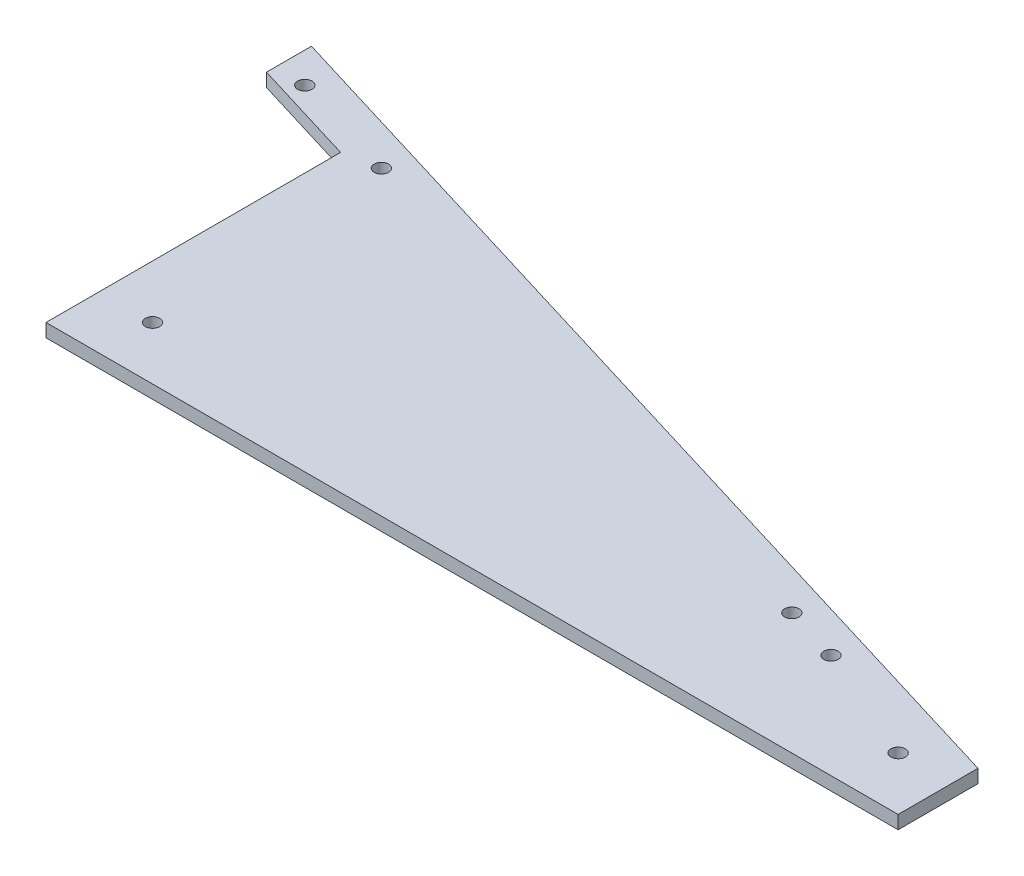
ISO-10303-21;
HEADER;
FILE_DESCRIPTION(('STEP AP214'),'2;1');
FILE_NAME('part.step','',(''),(''),'','','');
FILE_SCHEMA(('AUTOMOTIVE_DESIGN { 1 0 10303 214 1 1 1 1 }'));
ENDSEC;
DATA;
#1=APPLICATION_CONTEXT('core data for automotive mechanical design processes');
#2=APPLICATION_PROTOCOL_DEFINITION('international standard','automotive_design',2000,#1);
#3=PRODUCT_CONTEXT('',#1,'mechanical');
#4=PRODUCT('Part','Part','',(#3));
#5=PRODUCT_RELATED_PRODUCT_CATEGORY('part','',(#4));
#6=PRODUCT_DEFINITION_FORMATION('','',#4);
#7=PRODUCT_DEFINITION_CONTEXT('part definition',#1,'design');
#8=PRODUCT_DEFINITION('design','',#6,#7);
#9=PRODUCT_DEFINITION_SHAPE('','',#8);
#10=(LENGTH_UNIT() NAMED_UNIT(*) SI_UNIT(.MILLI.,.METRE.));
#11=(NAMED_UNIT(*) PLANE_ANGLE_UNIT() SI_UNIT($,.RADIAN.));
#12=(NAMED_UNIT(*) SI_UNIT($,.STERADIAN.) SOLID_ANGLE_UNIT());
#13=UNCERTAINTY_MEASURE_WITH_UNIT(LENGTH_MEASURE(1.E-05),#10,'distance_accuracy_value','');
#14=(GEOMETRIC_REPRESENTATION_CONTEXT(3) GLOBAL_UNCERTAINTY_ASSIGNED_CONTEXT((#13)) GLOBAL_UNIT_ASSIGNED_CONTEXT((#10,
#11,#12)) REPRESENTATION_CONTEXT('',''));
#15=CARTESIAN_POINT('',(0.,0.,0.));
#16=DIRECTION('',(0.,0.,1.));
#17=DIRECTION('',(1.,0.,0.));
#18=AXIS2_PLACEMENT_3D('',#15,#16,#17);
#19=CARTESIAN_POINT('',(0.,6.35,-161.925));
#20=DIRECTION('',(1.,0.,0.));
#21=DIRECTION('',(0.,0.,-1.));
#22=AXIS2_PLACEMENT_3D('',#19,#20,#21);
#23=PLANE('',#22);
#24=DIRECTION('',(0.,1.,0.));
#25=VECTOR('',#24,1.);
#26=CARTESIAN_POINT('',(0.,0.,-140.483107961387));
#27=LINE('',#26,#25);
#28=CARTESIAN_POINT('',(0.,0.,-140.483107961387));
#29=VERTEX_POINT('',#28);
#30=CARTESIAN_POINT('',(0.,6.35,-140.483107961387));
#31=VERTEX_POINT('',#30);
#32=EDGE_CURVE('E56',#29,#31,#27,.T.);
#33=ORIENTED_EDGE('',*,*,#32,.F.);
#34=DIRECTION('',(0.,0.,1.));
#35=VECTOR('',#34,1.);
#36=CARTESIAN_POINT('',(0.,0.,-161.925));
#37=LINE('',#36,#35);
#38=CARTESIAN_POINT('',(0.,0.,0.));
#39=VERTEX_POINT('',#38);
#40=EDGE_CURVE('E158',#29,#39,#37,.T.);
#41=ORIENTED_EDGE('',*,*,#40,.T.);
#42=DIRECTION('',(0.,-1.,0.));
#43=VECTOR('',#42,1.);
#44=CARTESIAN_POINT('',(0.,6.35,0.));
#45=LINE('',#44,#43);
#46=CARTESIAN_POINT('',(0.,6.35,0.));
#47=VERTEX_POINT('',#46);
#48=EDGE_CURVE('E11',#47,#39,#45,.T.);
#49=ORIENTED_EDGE('',*,*,#48,.F.);
#50=DIRECTION('',(0.,0.,1.));
#51=VECTOR('',#50,1.);
#52=CARTESIAN_POINT('',(0.,6.35,-161.925));
#53=LINE('',#52,#51);
#54=EDGE_CURVE('E85',#31,#47,#53,.T.);
#55=ORIENTED_EDGE('',*,*,#54,.F.);
#56=EDGE_LOOP('',(#33,#41,#49,#55));
#57=FACE_BOUND('',#56,.T.);
#58=ADVANCED_FACE('F41',(#57),#23,.F.);
#59=CARTESIAN_POINT('',(0.,6.35,0.));
#60=DIRECTION('',(0.,1.,0.));
#61=DIRECTION('',(0.,0.,1.));
#62=AXIS2_PLACEMENT_3D('',#59,#60,#61);
#63=PLANE('',#62);
#64=CARTESIAN_POINT('',(324.672621662797,6.35,-49.7248926931691));
#65=DIRECTION('',(0.,1.,0.));
#66=DIRECTION('',(0.,0.,1.));
#67=AXIS2_PLACEMENT_3D('',#64,#65,#66);
#68=CIRCLE('',#67,3.429);
#69=CARTESIAN_POINT('',(324.672621662797,6.35,-46.2958926931691));
#70=VERTEX_POINT('',#69);
#71=EDGE_CURVE('E338',#70,#70,#68,.T.);
#72=ORIENTED_EDGE('',*,*,#71,.F.);
#73=EDGE_LOOP('',(#72));
#74=FACE_BOUND('',#73,.T.);
#75=CARTESIAN_POINT('',(16.2615905718083,6.35,-143.693878728705));
#76=DIRECTION('',(0.,1.,0.));
#77=DIRECTION('',(0.,0.,1.));
#78=AXIS2_PLACEMENT_3D('',#75,#76,#77);
#79=CIRCLE('',#78,3.42899999999999);
#80=CARTESIAN_POINT('',(16.2615905718083,6.35,-140.264878728705));
#81=VERTEX_POINT('',#80);
#82=EDGE_CURVE('E346',#81,#81,#79,.T.);
#83=ORIENTED_EDGE('',*,*,#82,.F.);
#84=EDGE_LOOP('',(#83));
#85=FACE_BOUND('',#84,.T.);
#86=CARTESIAN_POINT('',(297.810987832806,6.35,-57.9092967507445));
#87=DIRECTION('',(0.,1.,0.));
#88=DIRECTION('',(0.,0.,1.));
#89=AXIS2_PLACEMENT_3D('',#86,#87,#88);
#90=CIRCLE('',#89,3.429);
#91=CARTESIAN_POINT('',(297.810987832806,6.35,-54.4802967507445));
#92=VERTEX_POINT('',#91);
#93=EDGE_CURVE('E354',#92,#92,#90,.T.);
#94=ORIENTED_EDGE('',*,*,#93,.F.);
#95=EDGE_LOOP('',(#94));
#96=FACE_BOUND('',#95,.T.);
#97=CARTESIAN_POINT('',(-36.2786166972877,6.35,-159.702223131007));
#98=DIRECTION('',(0.,1.,0.));
#99=DIRECTION('',(0.,0.,1.));
#100=AXIS2_PLACEMENT_3D('',#97,#98,#99);
#101=CIRCLE('',#100,3.42899999999999);
#102=CARTESIAN_POINT('',(-36.2786166972877,6.35,-156.273223131007));
#103=VERTEX_POINT('',#102);
#104=EDGE_CURVE('E360',#103,#103,#101,.T.);
#105=ORIENTED_EDGE('',*,*,#104,.F.);
#106=EDGE_LOOP('',(#105));
#107=FACE_BOUND('',#106,.T.);
#108=CARTESIAN_POINT('',(25.4,6.35,-25.4));
#109=DIRECTION('',(0.,1.,0.));
#110=DIRECTION('',(0.,0.,1.));
#111=AXIS2_PLACEMENT_3D('',#108,#109,#110);
#112=CIRCLE('',#111,3.429);
#113=CARTESIAN_POINT('',(25.4,6.35,-21.971));
#114=VERTEX_POINT('',#113);
#115=EDGE_CURVE('E154',#114,#114,#112,.T.);
#116=ORIENTED_EDGE('',*,*,#115,.F.);
#117=EDGE_LOOP('',(#116));
#118=FACE_BOUND('',#117,.T.);
#119=DIRECTION('',(-0.956583327027528,0.,-0.2914589824537));
#120=VECTOR('',#119,1.);
#121=CARTESIAN_POINT('',(406.4,6.35,-38.1));
#122=LINE('',#121,#120);
#123=CARTESIAN_POINT('',(406.4,6.35,-38.1));
#124=VERTEX_POINT('',#123);
#125=CARTESIAN_POINT('',(-50.8,6.35,-177.403125));
#126=VERTEX_POINT('',#125);
#127=EDGE_CURVE('E169',#124,#126,#122,.T.);
#128=ORIENTED_EDGE('',*,*,#127,.T.);
#129=DIRECTION('',(0.,0.,1.));
#130=VECTOR('',#129,1.);
#131=CARTESIAN_POINT('',(-50.8,6.35,-177.403125));
#132=LINE('',#131,#130);
#133=CARTESIAN_POINT('',(-50.8,6.35,-155.961232961387));
#134=VERTEX_POINT('',#133);
#135=EDGE_CURVE('E119',#126,#134,#132,.T.);
#136=ORIENTED_EDGE('',*,*,#135,.T.);
#137=DIRECTION('',(0.956583327027528,0.,0.2914589824537));
#138=VECTOR('',#137,1.);
#139=CARTESIAN_POINT('',(-50.8,6.35,-155.961232961387));
#140=LINE('',#139,#138);
#141=EDGE_CURVE('E128',#134,#31,#140,.T.);
#142=ORIENTED_EDGE('',*,*,#141,.T.);
#143=ORIENTED_EDGE('',*,*,#54,.T.);
#144=DIRECTION('',(1.,0.,0.));
#145=VECTOR('',#144,1.);
#146=CARTESIAN_POINT('',(0.,6.35,0.));
#147=LINE('',#146,#145);
#148=CARTESIAN_POINT('',(406.4,6.35,0.));
#149=VERTEX_POINT('',#148);
#150=EDGE_CURVE('E164',#47,#149,#147,.T.);
#151=ORIENTED_EDGE('',*,*,#150,.T.);
#152=DIRECTION('',(0.,0.,-1.));
#153=VECTOR('',#152,1.);
#154=CARTESIAN_POINT('',(406.4,6.35,0.));
#155=LINE('',#154,#153);
#156=EDGE_CURVE('E65',#149,#124,#155,.T.);
#157=ORIENTED_EDGE('',*,*,#156,.T.);
#158=EDGE_LOOP('',(#128,#136,#142,#143,#151,#157));
#159=FACE_BOUND('',#158,.T.);
#160=CARTESIAN_POINT('',(381.,6.35,-25.4));
#161=DIRECTION('',(0.,1.,0.));
#162=DIRECTION('',(0.,0.,1.));
#163=AXIS2_PLACEMENT_3D('',#160,#161,#162);
#164=CIRCLE('',#163,3.429);
#165=CARTESIAN_POINT('',(381.,6.35,-21.971));
#166=VERTEX_POINT('',#165);
#167=EDGE_CURVE('E146',#166,#166,#164,.T.);
#168=ORIENTED_EDGE('',*,*,#167,.F.);
#169=EDGE_LOOP('',(#168));
#170=FACE_BOUND('',#169,.T.);
#171=ADVANCED_FACE('F190',(#74,#85,#96,#107,#118,#159,#170),#63,.T.);
#172=CARTESIAN_POINT('',(0.,0.,0.));
#173=DIRECTION('',(0.,1.,0.));
#174=DIRECTION('',(0.,0.,1.));
#175=AXIS2_PLACEMENT_3D('',#172,#173,#174);
#176=PLANE('',#175);
#177=CARTESIAN_POINT('',(324.672621662797,0.,-49.7248926931691));
#178=DIRECTION('',(0.,1.,0.));
#179=DIRECTION('',(0.,0.,1.));
#180=AXIS2_PLACEMENT_3D('',#177,#178,#179);
#181=CIRCLE('',#180,3.429);
#182=CARTESIAN_POINT('',(324.672621662797,0.,-46.2958926931691));
#183=VERTEX_POINT('',#182);
#184=EDGE_CURVE('E139',#183,#183,#181,.F.);
#185=ORIENTED_EDGE('',*,*,#184,.F.);
#186=EDGE_LOOP('',(#185));
#187=FACE_BOUND('',#186,.T.);
#188=CARTESIAN_POINT('',(16.2615905718083,0.,-143.693878728705));
#189=DIRECTION('',(0.,1.,0.));
#190=DIRECTION('',(0.,0.,1.));
#191=AXIS2_PLACEMENT_3D('',#188,#189,#190);
#192=CIRCLE('',#191,3.42899999999999);
#193=CARTESIAN_POINT('',(16.2615905718083,0.,-140.264878728705));
#194=VERTEX_POINT('',#193);
#195=EDGE_CURVE('E343',#194,#194,#192,.F.);
#196=ORIENTED_EDGE('',*,*,#195,.F.);
#197=EDGE_LOOP('',(#196));
#198=FACE_BOUND('',#197,.T.);
#199=CARTESIAN_POINT('',(297.810987832806,0.,-57.9092967507445));
#200=DIRECTION('',(0.,1.,0.));
#201=DIRECTION('',(0.,0.,1.));
#202=AXIS2_PLACEMENT_3D('',#199,#200,#201);
#203=CIRCLE('',#202,3.429);
#204=CARTESIAN_POINT('',(297.810987832806,0.,-54.4802967507445));
#205=VERTEX_POINT('',#204);
#206=EDGE_CURVE('E350',#205,#205,#203,.F.);
#207=ORIENTED_EDGE('',*,*,#206,.F.);
#208=EDGE_LOOP('',(#207));
#209=FACE_BOUND('',#208,.T.);
#210=CARTESIAN_POINT('',(-36.2786166972877,0.,-159.702223131007));
#211=DIRECTION('',(0.,1.,0.));
#212=DIRECTION('',(0.,0.,1.));
#213=AXIS2_PLACEMENT_3D('',#210,#211,#212);
#214=CIRCLE('',#213,3.42899999999999);
#215=CARTESIAN_POINT('',(-36.2786166972877,0.,-156.273223131007));
#216=VERTEX_POINT('',#215);
#217=EDGE_CURVE('E135',#216,#216,#214,.F.);
#218=ORIENTED_EDGE('',*,*,#217,.F.);
#219=EDGE_LOOP('',(#218));
#220=FACE_BOUND('',#219,.T.);
#221=ORIENTED_EDGE('',*,*,#40,.F.);
#222=DIRECTION('',(0.956583327027528,0.,0.2914589824537));
#223=VECTOR('',#222,1.);
#224=CARTESIAN_POINT('',(-50.8,0.,-155.961232961387));
#225=LINE('',#224,#223);
#226=CARTESIAN_POINT('',(-50.8,0.,-155.961232961387));
#227=VERTEX_POINT('',#226);
#228=EDGE_CURVE('E122',#227,#29,#225,.T.);
#229=ORIENTED_EDGE('',*,*,#228,.F.);
#230=DIRECTION('',(0.,0.,1.));
#231=VECTOR('',#230,1.);
#232=CARTESIAN_POINT('',(-50.8,0.,-177.403125));
#233=LINE('',#232,#231);
#234=CARTESIAN_POINT('',(-50.8,0.,-177.403125));
#235=VERTEX_POINT('',#234);
#236=EDGE_CURVE('E116',#235,#227,#233,.T.);
#237=ORIENTED_EDGE('',*,*,#236,.F.);
#238=DIRECTION('',(-0.956583327027528,0.,-0.2914589824537));
#239=VECTOR('',#238,1.);
#240=CARTESIAN_POINT('',(406.4,0.,-38.1));
#241=LINE('',#240,#239);
#242=CARTESIAN_POINT('',(406.4,0.,-38.1));
#243=VERTEX_POINT('',#242);
#244=EDGE_CURVE('E102',#243,#235,#241,.T.);
#245=ORIENTED_EDGE('',*,*,#244,.F.);
#246=DIRECTION('',(0.,0.,-1.));
#247=VECTOR('',#246,1.);
#248=CARTESIAN_POINT('',(406.4,0.,0.));
#249=LINE('',#248,#247);
#250=CARTESIAN_POINT('',(406.4,0.,0.));
#251=VERTEX_POINT('',#250);
#252=EDGE_CURVE('E81',#251,#243,#249,.T.);
#253=ORIENTED_EDGE('',*,*,#252,.F.);
#254=DIRECTION('',(1.,0.,0.));
#255=VECTOR('',#254,1.);
#256=CARTESIAN_POINT('',(0.,0.,0.));
#257=LINE('',#256,#255);
#258=EDGE_CURVE('E174',#39,#251,#257,.T.);
#259=ORIENTED_EDGE('',*,*,#258,.F.);
#260=EDGE_LOOP('',(#221,#229,#237,#245,#253,#259));
#261=FACE_BOUND('',#260,.T.);
#262=CARTESIAN_POINT('',(25.4,0.,-25.4));
#263=DIRECTION('',(0.,1.,0.));
#264=DIRECTION('',(0.,0.,1.));
#265=AXIS2_PLACEMENT_3D('',#262,#263,#264);
#266=CIRCLE('',#265,3.429);
#267=CARTESIAN_POINT('',(25.4,0.,-21.971));
#268=VERTEX_POINT('',#267);
#269=EDGE_CURVE('E150',#268,#268,#266,.T.);
#270=ORIENTED_EDGE('',*,*,#269,.T.);
#271=EDGE_LOOP('',(#270));
#272=FACE_BOUND('',#271,.T.);
#273=CARTESIAN_POINT('',(381.,0.,-25.4));
#274=DIRECTION('',(0.,1.,0.));
#275=DIRECTION('',(0.,0.,1.));
#276=AXIS2_PLACEMENT_3D('',#273,#274,#275);
#277=CIRCLE('',#276,3.429);
#278=CARTESIAN_POINT('',(381.,0.,-21.971));
#279=VERTEX_POINT('',#278);
#280=EDGE_CURVE('E143',#279,#279,#277,.T.);
#281=ORIENTED_EDGE('',*,*,#280,.T.);
#282=EDGE_LOOP('',(#281));
#283=FACE_BOUND('',#282,.T.);
#284=ADVANCED_FACE('F124',(#187,#198,#209,#220,#261,#272,#283),#176,.F.);
#285=CARTESIAN_POINT('',(0.,6.35,0.));
#286=DIRECTION('',(0.,0.,-1.));
#287=DIRECTION('',(-1.,0.,0.));
#288=AXIS2_PLACEMENT_3D('',#285,#286,#287);
#289=PLANE('',#288);
#290=ORIENTED_EDGE('',*,*,#258,.T.);
#291=DIRECTION('',(0.,-1.,0.));
#292=VECTOR('',#291,1.);
#293=CARTESIAN_POINT('',(406.4,6.35,0.));
#294=LINE('',#293,#292);
#295=EDGE_CURVE('E49',#149,#251,#294,.T.);
#296=ORIENTED_EDGE('',*,*,#295,.F.);
#297=ORIENTED_EDGE('',*,*,#150,.F.);
#298=ORIENTED_EDGE('',*,*,#48,.T.);
#299=EDGE_LOOP('',(#290,#296,#297,#298));
#300=FACE_BOUND('',#299,.T.);
#301=ADVANCED_FACE('F186',(#300),#289,.F.);
#302=CARTESIAN_POINT('',(406.4,6.35,0.));
#303=DIRECTION('',(-1.,0.,0.));
#304=DIRECTION('',(0.,0.,1.));
#305=AXIS2_PLACEMENT_3D('',#302,#303,#304);
#306=PLANE('',#305);
#307=ORIENTED_EDGE('',*,*,#252,.T.);
#308=DIRECTION('',(0.,-1.,0.));
#309=VECTOR('',#308,1.);
#310=CARTESIAN_POINT('',(406.4,6.35,-38.1));
#311=LINE('',#310,#309);
#312=EDGE_CURVE('E108',#124,#243,#311,.T.);
#313=ORIENTED_EDGE('',*,*,#312,.F.);
#314=ORIENTED_EDGE('',*,*,#156,.F.);
#315=ORIENTED_EDGE('',*,*,#295,.T.);
#316=EDGE_LOOP('',(#307,#313,#314,#315));
#317=FACE_BOUND('',#316,.T.);
#318=ADVANCED_FACE('F182',(#317),#306,.F.);
#319=CARTESIAN_POINT('',(406.4,6.35,-38.1));
#320=DIRECTION('',(-0.2914589824537,0.,0.956583327027528));
#321=DIRECTION('',(0.956583327027528,0.,0.2914589824537));
#322=AXIS2_PLACEMENT_3D('',#319,#320,#321);
#323=PLANE('',#322);
#324=ORIENTED_EDGE('',*,*,#244,.T.);
#325=DIRECTION('',(0.,1.,0.));
#326=VECTOR('',#325,1.);
#327=CARTESIAN_POINT('',(-50.8,0.,-177.403125));
#328=LINE('',#327,#326);
#329=EDGE_CURVE('E106',#235,#126,#328,.T.);
#330=ORIENTED_EDGE('',*,*,#329,.T.);
#331=ORIENTED_EDGE('',*,*,#127,.F.);
#332=ORIENTED_EDGE('',*,*,#312,.T.);
#333=EDGE_LOOP('',(#324,#330,#331,#332));
#334=FACE_BOUND('',#333,.T.);
#335=ADVANCED_FACE('F104',(#334),#323,.F.);
#336=CARTESIAN_POINT('',(25.4,6.35,-25.4));
#337=DIRECTION('',(0.,-1.,0.));
#338=DIRECTION('',(0.,0.,-1.));
#339=AXIS2_PLACEMENT_3D('',#336,#337,#338);
#340=CYLINDRICAL_SURFACE('',#339,3.429);
#341=ORIENTED_EDGE('',*,*,#115,.T.);
#342=EDGE_LOOP('',(#341));
#343=FACE_BOUND('',#342,.T.);
#344=ORIENTED_EDGE('',*,*,#269,.F.);
#345=EDGE_LOOP('',(#344));
#346=FACE_BOUND('',#345,.T.);
#347=ADVANCED_FACE('F200',(#343,#346),#340,.F.);
#348=CARTESIAN_POINT('',(381.,6.35,-25.4));
#349=DIRECTION('',(0.,-1.,0.));
#350=DIRECTION('',(0.,0.,-1.));
#351=AXIS2_PLACEMENT_3D('',#348,#349,#350);
#352=CYLINDRICAL_SURFACE('',#351,3.429);
#353=ORIENTED_EDGE('',*,*,#167,.T.);
#354=EDGE_LOOP('',(#353));
#355=FACE_BOUND('',#354,.T.);
#356=ORIENTED_EDGE('',*,*,#280,.F.);
#357=EDGE_LOOP('',(#356));
#358=FACE_BOUND('',#357,.T.);
#359=ADVANCED_FACE('F197',(#355,#358),#352,.F.);
#360=CARTESIAN_POINT('',(-50.8,0.,-155.961232961387));
#361=DIRECTION('',(-0.2914589824537,0.,0.956583327027528));
#362=DIRECTION('',(0.956583327027528,0.,0.2914589824537));
#363=AXIS2_PLACEMENT_3D('',#360,#361,#362);
#364=PLANE('',#363);
#365=ORIENTED_EDGE('',*,*,#141,.F.);
#366=DIRECTION('',(0.,1.,0.));
#367=VECTOR('',#366,1.);
#368=CARTESIAN_POINT('',(-50.8,0.,-155.961232961387));
#369=LINE('',#368,#367);
#370=EDGE_CURVE('E121',#227,#134,#369,.T.);
#371=ORIENTED_EDGE('',*,*,#370,.F.);
#372=ORIENTED_EDGE('',*,*,#228,.T.);
#373=ORIENTED_EDGE('',*,*,#32,.T.);
#374=EDGE_LOOP('',(#365,#371,#372,#373));
#375=FACE_BOUND('',#374,.T.);
#376=ADVANCED_FACE('F189',(#375),#364,.T.);
#377=CARTESIAN_POINT('',(-50.8,0.,-177.403125));
#378=DIRECTION('',(-1.,0.,0.));
#379=DIRECTION('',(0.,0.,1.));
#380=AXIS2_PLACEMENT_3D('',#377,#378,#379);
#381=PLANE('',#380);
#382=ORIENTED_EDGE('',*,*,#135,.F.);
#383=ORIENTED_EDGE('',*,*,#329,.F.);
#384=ORIENTED_EDGE('',*,*,#236,.T.);
#385=ORIENTED_EDGE('',*,*,#370,.T.);
#386=EDGE_LOOP('',(#382,#383,#384,#385));
#387=FACE_BOUND('',#386,.T.);
#388=ADVANCED_FACE('F115',(#387),#381,.T.);
#389=CARTESIAN_POINT('',(-36.2786166972877,-0.00100000000000013,-159.702223131007));
#390=DIRECTION('',(0.,1.,0.));
#391=DIRECTION('',(0.,0.,1.));
#392=AXIS2_PLACEMENT_3D('',#389,#390,#391);
#393=CYLINDRICAL_SURFACE('',#392,3.42899999999999);
#394=ORIENTED_EDGE('',*,*,#104,.T.);
#395=EDGE_LOOP('',(#394));
#396=FACE_BOUND('',#395,.T.);
#397=ORIENTED_EDGE('',*,*,#217,.T.);
#398=EDGE_LOOP('',(#397));
#399=FACE_BOUND('',#398,.T.);
#400=ADVANCED_FACE('F239',(#396,#399),#393,.F.);
#401=CARTESIAN_POINT('',(297.810987832806,-0.00100000000000013,-57.9092967507445));
#402=DIRECTION('',(0.,1.,0.));
#403=DIRECTION('',(0.,0.,1.));
#404=AXIS2_PLACEMENT_3D('',#401,#402,#403);
#405=CYLINDRICAL_SURFACE('',#404,3.429);
#406=ORIENTED_EDGE('',*,*,#93,.T.);
#407=EDGE_LOOP('',(#406));
#408=FACE_BOUND('',#407,.T.);
#409=ORIENTED_EDGE('',*,*,#206,.T.);
#410=EDGE_LOOP('',(#409));
#411=FACE_BOUND('',#410,.T.);
#412=ADVANCED_FACE('F244',(#408,#411),#405,.F.);
#413=CARTESIAN_POINT('',(16.2615905718083,-0.00100000000000013,-143.693878728705));
#414=DIRECTION('',(0.,1.,0.));
#415=DIRECTION('',(0.,0.,1.));
#416=AXIS2_PLACEMENT_3D('',#413,#414,#415);
#417=CYLINDRICAL_SURFACE('',#416,3.42899999999999);
#418=ORIENTED_EDGE('',*,*,#82,.T.);
#419=EDGE_LOOP('',(#418));
#420=FACE_BOUND('',#419,.T.);
#421=ORIENTED_EDGE('',*,*,#195,.T.);
#422=EDGE_LOOP('',(#421));
#423=FACE_BOUND('',#422,.T.);
#424=ADVANCED_FACE('F254',(#420,#423),#417,.F.);
#425=CARTESIAN_POINT('',(324.672621662797,-0.00100000000000013,-49.7248926931691));
#426=DIRECTION('',(0.,1.,0.));
#427=DIRECTION('',(0.,0.,1.));
#428=AXIS2_PLACEMENT_3D('',#425,#426,#427);
#429=CYLINDRICAL_SURFACE('',#428,3.429);
#430=ORIENTED_EDGE('',*,*,#71,.T.);
#431=EDGE_LOOP('',(#430));
#432=FACE_BOUND('',#431,.T.);
#433=ORIENTED_EDGE('',*,*,#184,.T.);
#434=EDGE_LOOP('',(#433));
#435=FACE_BOUND('',#434,.T.);
#436=ADVANCED_FACE('F264',(#432,#435),#429,.F.);
#437=CLOSED_SHELL('',(#58,#171,#284,#301,#318,#335,#347,#359,#376,#388,#400,#412,#424,#436));
#438=MANIFOLD_SOLID_BREP('B2',#437);
#439=ADVANCED_BREP_SHAPE_REPRESENTATION('',(#18,#438),#14);
#440=SHAPE_DEFINITION_REPRESENTATION(#9,#439);
ENDSEC;
END-ISO-10303-21;
